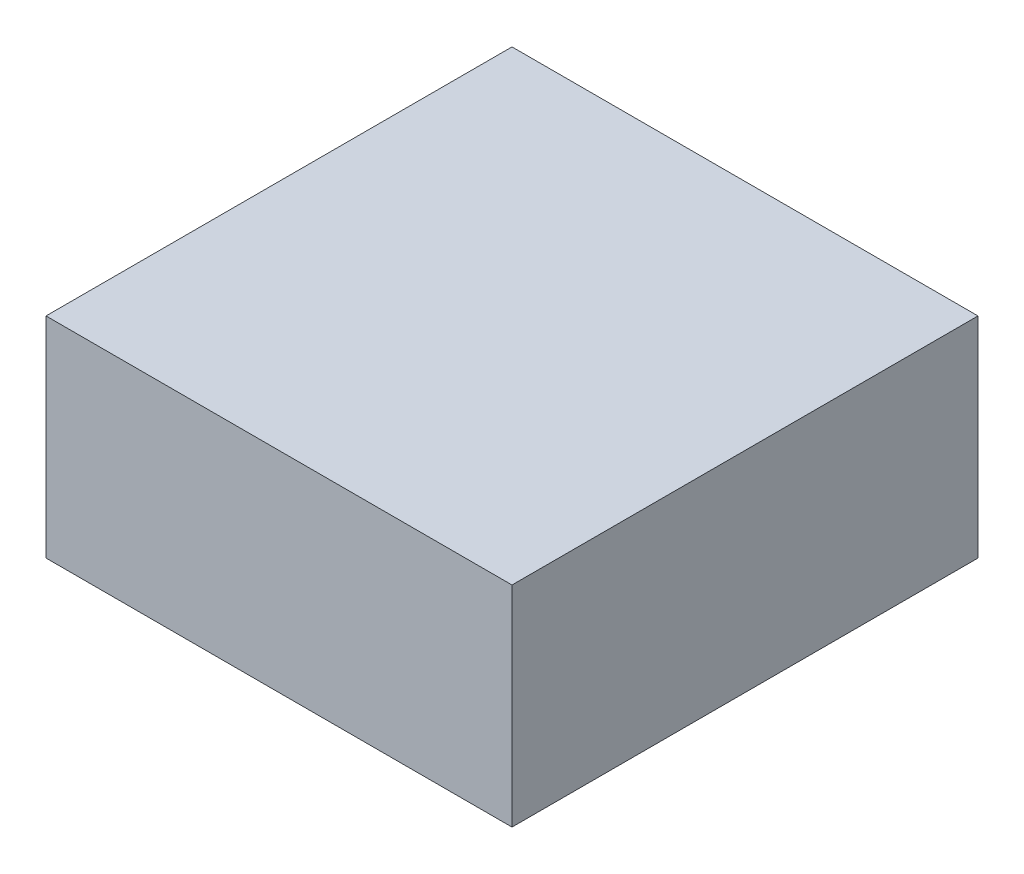
ISO-10303-21;
HEADER;
FILE_DESCRIPTION(('STEP AP214'),'2;1');
FILE_NAME('part.step','',(''),(''),'','','');
FILE_SCHEMA(('AUTOMOTIVE_DESIGN { 1 0 10303 214 1 1 1 1 }'));
ENDSEC;
DATA;
#1=APPLICATION_CONTEXT('core data for automotive mechanical design processes');
#2=APPLICATION_PROTOCOL_DEFINITION('international standard','automotive_design',2000,#1);
#3=PRODUCT_CONTEXT('',#1,'mechanical');
#4=PRODUCT('Part','Part','',(#3));
#5=PRODUCT_RELATED_PRODUCT_CATEGORY('part','',(#4));
#6=PRODUCT_DEFINITION_FORMATION('','',#4);
#7=PRODUCT_DEFINITION_CONTEXT('part definition',#1,'design');
#8=PRODUCT_DEFINITION('design','',#6,#7);
#9=PRODUCT_DEFINITION_SHAPE('','',#8);
#10=(LENGTH_UNIT() NAMED_UNIT(*) SI_UNIT(.MILLI.,.METRE.));
#11=(NAMED_UNIT(*) PLANE_ANGLE_UNIT() SI_UNIT($,.RADIAN.));
#12=(NAMED_UNIT(*) SI_UNIT($,.STERADIAN.) SOLID_ANGLE_UNIT());
#13=UNCERTAINTY_MEASURE_WITH_UNIT(LENGTH_MEASURE(1.E-05),#10,'distance_accuracy_value','');
#14=(GEOMETRIC_REPRESENTATION_CONTEXT(3) GLOBAL_UNCERTAINTY_ASSIGNED_CONTEXT((#13)) GLOBAL_UNIT_ASSIGNED_CONTEXT((#10,
#11,#12)) REPRESENTATION_CONTEXT('',''));
#15=CARTESIAN_POINT('',(0.,0.,0.));
#16=DIRECTION('',(0.,0.,1.));
#17=DIRECTION('',(1.,0.,0.));
#18=AXIS2_PLACEMENT_3D('',#15,#16,#17);
#19=CARTESIAN_POINT('',(0.,0.,0.));
#20=DIRECTION('',(0.,1.,0.));
#21=DIRECTION('',(0.,0.,1.));
#22=AXIS2_PLACEMENT_3D('',#19,#20,#21);
#23=PLANE('',#22);
#24=DIRECTION('',(-1.,0.,0.));
#25=VECTOR('',#24,1.);
#26=CARTESIAN_POINT('',(-2.,0.,2.));
#27=LINE('',#26,#25);
#28=CARTESIAN_POINT('',(2.,0.,2.));
#29=VERTEX_POINT('',#28);
#30=CARTESIAN_POINT('',(-2.,0.,2.));
#31=VERTEX_POINT('',#30);
#32=EDGE_CURVE('E81',#29,#31,#27,.T.);
#33=ORIENTED_EDGE('',*,*,#32,.T.);
#34=DIRECTION('',(0.,0.,-1.));
#35=VECTOR('',#34,1.);
#36=CARTESIAN_POINT('',(-2.,0.,-2.));
#37=LINE('',#36,#35);
#38=CARTESIAN_POINT('',(-2.,0.,-2.));
#39=VERTEX_POINT('',#38);
#40=EDGE_CURVE('E68',#31,#39,#37,.T.);
#41=ORIENTED_EDGE('',*,*,#40,.T.);
#42=DIRECTION('',(1.,0.,0.));
#43=VECTOR('',#42,1.);
#44=CARTESIAN_POINT('',(-2.,0.,-2.));
#45=LINE('',#44,#43);
#46=CARTESIAN_POINT('',(2.,0.,-2.));
#47=VERTEX_POINT('',#46);
#48=EDGE_CURVE('E55',#39,#47,#45,.T.);
#49=ORIENTED_EDGE('',*,*,#48,.T.);
#50=DIRECTION('',(0.,0.,1.));
#51=VECTOR('',#50,1.);
#52=CARTESIAN_POINT('',(2.,0.,-2.));
#53=LINE('',#52,#51);
#54=EDGE_CURVE('E20',#47,#29,#53,.T.);
#55=ORIENTED_EDGE('',*,*,#54,.T.);
#56=EDGE_LOOP('',(#33,#41,#49,#55));
#57=FACE_BOUND('',#56,.T.);
#58=ADVANCED_FACE('F17',(#57),#23,.F.);
#59=CARTESIAN_POINT('',(2.,1.8,-2.));
#60=DIRECTION('',(-1.,0.,0.));
#61=DIRECTION('',(0.,0.,1.));
#62=AXIS2_PLACEMENT_3D('',#59,#60,#61);
#63=PLANE('',#62);
#64=DIRECTION('',(0.,1.,0.));
#65=VECTOR('',#64,1.);
#66=CARTESIAN_POINT('',(2.,1.8,-2.));
#67=LINE('',#66,#65);
#68=CARTESIAN_POINT('',(2.,1.8,-2.));
#69=VERTEX_POINT('',#68);
#70=EDGE_CURVE('E61',#47,#69,#67,.T.);
#71=ORIENTED_EDGE('',*,*,#70,.T.);
#72=DIRECTION('',(0.,0.,1.));
#73=VECTOR('',#72,1.);
#74=CARTESIAN_POINT('',(2.,1.8,0.));
#75=LINE('',#74,#73);
#76=CARTESIAN_POINT('',(2.,1.8,2.));
#77=VERTEX_POINT('',#76);
#78=EDGE_CURVE('E83',#77,#69,#75,.F.);
#79=ORIENTED_EDGE('',*,*,#78,.F.);
#80=DIRECTION('',(0.,1.,0.));
#81=VECTOR('',#80,1.);
#82=CARTESIAN_POINT('',(2.,1.8,2.));
#83=LINE('',#82,#81);
#84=EDGE_CURVE('E64',#77,#29,#83,.F.);
#85=ORIENTED_EDGE('',*,*,#84,.T.);
#86=ORIENTED_EDGE('',*,*,#54,.F.);
#87=EDGE_LOOP('',(#71,#79,#85,#86));
#88=FACE_BOUND('',#87,.T.);
#89=ADVANCED_FACE('F60',(#88),#63,.F.);
#90=CARTESIAN_POINT('',(-2.,1.8,-2.));
#91=DIRECTION('',(0.,0.,1.));
#92=DIRECTION('',(1.,0.,0.));
#93=AXIS2_PLACEMENT_3D('',#90,#91,#92);
#94=PLANE('',#93);
#95=DIRECTION('',(0.,1.,0.));
#96=VECTOR('',#95,1.);
#97=CARTESIAN_POINT('',(-2.,1.8,-2.));
#98=LINE('',#97,#96);
#99=CARTESIAN_POINT('',(-2.,1.8,-2.));
#100=VERTEX_POINT('',#99);
#101=EDGE_CURVE('E70',#39,#100,#98,.T.);
#102=ORIENTED_EDGE('',*,*,#101,.T.);
#103=DIRECTION('',(1.,0.,0.));
#104=VECTOR('',#103,1.);
#105=CARTESIAN_POINT('',(0.,1.8,-2.));
#106=LINE('',#105,#104);
#107=EDGE_CURVE('E74',#69,#100,#106,.F.);
#108=ORIENTED_EDGE('',*,*,#107,.F.);
#109=ORIENTED_EDGE('',*,*,#70,.F.);
#110=ORIENTED_EDGE('',*,*,#48,.F.);
#111=EDGE_LOOP('',(#102,#108,#109,#110));
#112=FACE_BOUND('',#111,.T.);
#113=ADVANCED_FACE('F72',(#112),#94,.F.);
#114=CARTESIAN_POINT('',(-2.,1.8,-2.));
#115=DIRECTION('',(1.,0.,0.));
#116=DIRECTION('',(0.,0.,-1.));
#117=AXIS2_PLACEMENT_3D('',#114,#115,#116);
#118=PLANE('',#117);
#119=DIRECTION('',(0.,1.,0.));
#120=VECTOR('',#119,1.);
#121=CARTESIAN_POINT('',(-2.,1.8,2.));
#122=LINE('',#121,#120);
#123=CARTESIAN_POINT('',(-2.,1.8,2.));
#124=VERTEX_POINT('',#123);
#125=EDGE_CURVE('E35',#31,#124,#122,.T.);
#126=ORIENTED_EDGE('',*,*,#125,.T.);
#127=DIRECTION('',(0.,0.,1.));
#128=VECTOR('',#127,1.);
#129=CARTESIAN_POINT('',(-2.,1.8,0.));
#130=LINE('',#129,#128);
#131=EDGE_CURVE('E26',#100,#124,#130,.T.);
#132=ORIENTED_EDGE('',*,*,#131,.F.);
#133=ORIENTED_EDGE('',*,*,#101,.F.);
#134=ORIENTED_EDGE('',*,*,#40,.F.);
#135=EDGE_LOOP('',(#126,#132,#133,#134));
#136=FACE_BOUND('',#135,.T.);
#137=ADVANCED_FACE('F89',(#136),#118,.F.);
#138=CARTESIAN_POINT('',(-2.,1.8,2.));
#139=DIRECTION('',(0.,0.,-1.));
#140=DIRECTION('',(-1.,0.,0.));
#141=AXIS2_PLACEMENT_3D('',#138,#139,#140);
#142=PLANE('',#141);
#143=ORIENTED_EDGE('',*,*,#84,.F.);
#144=DIRECTION('',(1.,0.,0.));
#145=VECTOR('',#144,1.);
#146=CARTESIAN_POINT('',(0.,1.8,2.));
#147=LINE('',#146,#145);
#148=EDGE_CURVE('E11',#124,#77,#147,.T.);
#149=ORIENTED_EDGE('',*,*,#148,.F.);
#150=ORIENTED_EDGE('',*,*,#125,.F.);
#151=ORIENTED_EDGE('',*,*,#32,.F.);
#152=EDGE_LOOP('',(#143,#149,#150,#151));
#153=FACE_BOUND('',#152,.T.);
#154=ADVANCED_FACE('F91',(#153),#142,.F.);
#155=CARTESIAN_POINT('',(0.,1.8,0.));
#156=DIRECTION('',(0.,1.,0.));
#157=DIRECTION('',(0.,0.,1.));
#158=AXIS2_PLACEMENT_3D('',#155,#156,#157);
#159=PLANE('',#158);
#160=ORIENTED_EDGE('',*,*,#131,.T.);
#161=ORIENTED_EDGE('',*,*,#148,.T.);
#162=ORIENTED_EDGE('',*,*,#78,.T.);
#163=ORIENTED_EDGE('',*,*,#107,.T.);
#164=EDGE_LOOP('',(#160,#161,#162,#163));
#165=FACE_BOUND('',#164,.T.);
#166=ADVANCED_FACE('F88',(#165),#159,.T.);
#167=CLOSED_SHELL('',(#58,#89,#113,#137,#154,#166));
#168=MANIFOLD_SOLID_BREP('B1',#167);
#169=ADVANCED_BREP_SHAPE_REPRESENTATION('',(#18,#168),#14);
#170=SHAPE_DEFINITION_REPRESENTATION(#9,#169);
ENDSEC;
END-ISO-10303-21;
